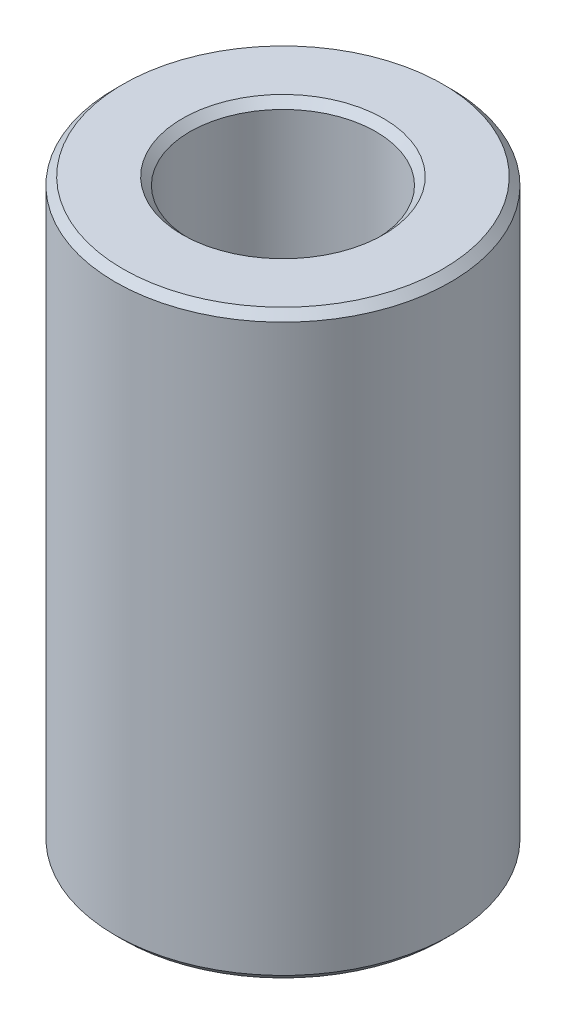
ISO-10303-21;
HEADER;
FILE_DESCRIPTION(('STEP AP214'),'2;1');
FILE_NAME('part.step','',(''),(''),'','','');
FILE_SCHEMA(('AUTOMOTIVE_DESIGN { 1 0 10303 214 1 1 1 1 }'));
ENDSEC;
DATA;
#1=APPLICATION_CONTEXT('core data for automotive mechanical design processes');
#2=APPLICATION_PROTOCOL_DEFINITION('international standard','automotive_design',2000,#1);
#3=PRODUCT_CONTEXT('',#1,'mechanical');
#4=PRODUCT('Part','Part','',(#3));
#5=PRODUCT_RELATED_PRODUCT_CATEGORY('part','',(#4));
#6=PRODUCT_DEFINITION_FORMATION('','',#4);
#7=PRODUCT_DEFINITION_CONTEXT('part definition',#1,'design');
#8=PRODUCT_DEFINITION('design','',#6,#7);
#9=PRODUCT_DEFINITION_SHAPE('','',#8);
#10=(LENGTH_UNIT() NAMED_UNIT(*) SI_UNIT(.MILLI.,.METRE.));
#11=(NAMED_UNIT(*) PLANE_ANGLE_UNIT() SI_UNIT($,.RADIAN.));
#12=(NAMED_UNIT(*) SI_UNIT($,.STERADIAN.) SOLID_ANGLE_UNIT());
#13=UNCERTAINTY_MEASURE_WITH_UNIT(LENGTH_MEASURE(1.E-05),#10,'distance_accuracy_value','');
#14=(GEOMETRIC_REPRESENTATION_CONTEXT(3) GLOBAL_UNCERTAINTY_ASSIGNED_CONTEXT((#13)) GLOBAL_UNIT_ASSIGNED_CONTEXT((#10,
#11,#12)) REPRESENTATION_CONTEXT('',''));
#15=CARTESIAN_POINT('',(0.,0.,0.));
#16=DIRECTION('',(0.,0.,1.));
#17=DIRECTION('',(1.,0.,0.));
#18=AXIS2_PLACEMENT_3D('',#15,#16,#17);
#19=CARTESIAN_POINT('',(0.,95.3080789271913,0.));
#20=DIRECTION('',(0.,-1.,0.));
#21=DIRECTION('',(0.,0.,-1.));
#22=AXIS2_PLACEMENT_3D('',#19,#20,#21);
#23=CYLINDRICAL_SURFACE('',#22,27.5);
#24=CARTESIAN_POINT('',(0.,1.24708160660957,0.));
#25=DIRECTION('',(0.,1.,0.));
#26=DIRECTION('',(0.,0.,1.));
#27=AXIS2_PLACEMENT_3D('',#24,#25,#26);
#28=CIRCLE('',#27,27.5);
#29=CARTESIAN_POINT('',(0.,1.24708160660957,27.5));
#30=VERTEX_POINT('',#29);
#31=EDGE_CURVE('E10',#30,#30,#28,.T.);
#32=ORIENTED_EDGE('',*,*,#31,.T.);
#33=EDGE_LOOP('',(#32));
#34=FACE_BOUND('',#33,.T.);
#35=CARTESIAN_POINT('',(0.,94.0609973205817,0.));
#36=DIRECTION('',(0.,1.,0.));
#37=DIRECTION('',(0.,0.,1.));
#38=AXIS2_PLACEMENT_3D('',#35,#36,#37);
#39=CIRCLE('',#38,27.5);
#40=CARTESIAN_POINT('',(0.,94.0609973205817,27.5));
#41=VERTEX_POINT('',#40);
#42=EDGE_CURVE('E50',#41,#41,#39,.F.);
#43=ORIENTED_EDGE('',*,*,#42,.T.);
#44=EDGE_LOOP('',(#43));
#45=FACE_BOUND('',#44,.T.);
#46=ADVANCED_FACE('F39',(#34,#45),#23,.T.);
#47=CARTESIAN_POINT('',(0.,95.3080789271913,0.));
#48=DIRECTION('',(0.,1.,0.));
#49=DIRECTION('',(0.,0.,1.));
#50=AXIS2_PLACEMENT_3D('',#47,#48,#49);
#51=PLANE('',#50);
#52=CARTESIAN_POINT('',(0.,95.3080789271913,0.));
#53=DIRECTION('',(0.,1.,0.));
#54=DIRECTION('',(0.,0.,1.));
#55=AXIS2_PLACEMENT_3D('',#52,#53,#54);
#56=CIRCLE('',#55,16.5118054933737);
#57=CARTESIAN_POINT('',(0.,95.3080789271913,16.5118054933737));
#58=VERTEX_POINT('',#57);
#59=EDGE_CURVE('E58',#58,#58,#56,.F.);
#60=ORIENTED_EDGE('',*,*,#59,.T.);
#61=EDGE_LOOP('',(#60));
#62=FACE_BOUND('',#61,.T.);
#63=CARTESIAN_POINT('',(0.,95.3080789271913,0.));
#64=DIRECTION('',(0.,1.,0.));
#65=DIRECTION('',(0.,0.,1.));
#66=AXIS2_PLACEMENT_3D('',#63,#64,#65);
#67=CIRCLE('',#66,26.2529183933904);
#68=CARTESIAN_POINT('',(0.,95.3080789271913,26.2529183933904));
#69=VERTEX_POINT('',#68);
#70=EDGE_CURVE('E61',#69,#69,#67,.T.);
#71=ORIENTED_EDGE('',*,*,#70,.T.);
#72=EDGE_LOOP('',(#71));
#73=FACE_BOUND('',#72,.T.);
#74=ADVANCED_FACE('F88',(#62,#73),#51,.T.);
#75=CARTESIAN_POINT('',(0.,0.,0.));
#76=DIRECTION('',(0.,1.,0.));
#77=DIRECTION('',(0.,0.,1.));
#78=AXIS2_PLACEMENT_3D('',#75,#76,#77);
#79=PLANE('',#78);
#80=CARTESIAN_POINT('',(0.,0.,0.));
#81=DIRECTION('',(0.,1.,0.));
#82=DIRECTION('',(0.,0.,1.));
#83=AXIS2_PLACEMENT_3D('',#80,#81,#82);
#84=CIRCLE('',#83,16.5118054933737);
#85=CARTESIAN_POINT('',(0.,0.,16.5118054933737));
#86=VERTEX_POINT('',#85);
#87=EDGE_CURVE('E51',#86,#86,#84,.T.);
#88=ORIENTED_EDGE('',*,*,#87,.T.);
#89=EDGE_LOOP('',(#88));
#90=FACE_BOUND('',#89,.T.);
#91=CARTESIAN_POINT('',(0.,0.,0.));
#92=DIRECTION('',(0.,1.,0.));
#93=DIRECTION('',(0.,0.,1.));
#94=AXIS2_PLACEMENT_3D('',#91,#92,#93);
#95=CIRCLE('',#94,26.2529183933904);
#96=CARTESIAN_POINT('',(0.,0.,26.2529183933904));
#97=VERTEX_POINT('',#96);
#98=EDGE_CURVE('E54',#97,#97,#95,.F.);
#99=ORIENTED_EDGE('',*,*,#98,.T.);
#100=EDGE_LOOP('',(#99));
#101=FACE_BOUND('',#100,.T.);
#102=ADVANCED_FACE('F83',(#90,#101),#79,.F.);
#103=CARTESIAN_POINT('',(0.,95.3080789271913,0.));
#104=DIRECTION('',(0.,-1.,0.));
#105=DIRECTION('',(0.,0.,-1.));
#106=AXIS2_PLACEMENT_3D('',#103,#104,#105);
#107=CYLINDRICAL_SURFACE('',#106,15.2647238867642);
#108=CARTESIAN_POINT('',(0.,94.0609973205818,0.));
#109=DIRECTION('',(0.,1.,0.));
#110=DIRECTION('',(0.,0.,1.));
#111=AXIS2_PLACEMENT_3D('',#108,#109,#110);
#112=CIRCLE('',#111,15.2647238867642);
#113=CARTESIAN_POINT('',(0.,94.0609973205818,15.2647238867642));
#114=VERTEX_POINT('',#113);
#115=EDGE_CURVE('E67',#114,#114,#112,.T.);
#116=ORIENTED_EDGE('',*,*,#115,.T.);
#117=EDGE_LOOP('',(#116));
#118=FACE_BOUND('',#117,.T.);
#119=CARTESIAN_POINT('',(0.,1.24708160660957,0.));
#120=DIRECTION('',(0.,1.,0.));
#121=DIRECTION('',(0.,0.,1.));
#122=AXIS2_PLACEMENT_3D('',#119,#120,#121);
#123=CIRCLE('',#122,15.2647238867642);
#124=CARTESIAN_POINT('',(0.,1.24708160660957,15.2647238867642));
#125=VERTEX_POINT('',#124);
#126=EDGE_CURVE('E69',#125,#125,#123,.F.);
#127=ORIENTED_EDGE('',*,*,#126,.T.);
#128=EDGE_LOOP('',(#127));
#129=FACE_BOUND('',#128,.T.);
#130=ADVANCED_FACE('F71',(#118,#129),#107,.F.);
#131=CARTESIAN_POINT('',(0.,94.0609973205818,0.));
#132=DIRECTION('',(0.,1.,0.));
#133=DIRECTION('',(0.,0.,1.));
#134=AXIS2_PLACEMENT_3D('',#131,#132,#133);
#135=CONICAL_SURFACE('',#134,15.2647238867642,0.785398163397451);
#136=ORIENTED_EDGE('',*,*,#59,.F.);
#137=EDGE_LOOP('',(#136));
#138=FACE_BOUND('',#137,.T.);
#139=ORIENTED_EDGE('',*,*,#115,.F.);
#140=EDGE_LOOP('',(#139));
#141=FACE_BOUND('',#140,.T.);
#142=ADVANCED_FACE('F77',(#138,#141),#135,.F.);
#143=CARTESIAN_POINT('',(0.,0.,0.));
#144=DIRECTION('',(0.,-1.,0.));
#145=DIRECTION('',(0.,0.,-1.));
#146=AXIS2_PLACEMENT_3D('',#143,#144,#145);
#147=CONICAL_SURFACE('',#146,16.5118054933737,0.785398163397446);
#148=ORIENTED_EDGE('',*,*,#126,.F.);
#149=EDGE_LOOP('',(#148));
#150=FACE_BOUND('',#149,.T.);
#151=ORIENTED_EDGE('',*,*,#87,.F.);
#152=EDGE_LOOP('',(#151));
#153=FACE_BOUND('',#152,.T.);
#154=ADVANCED_FACE('F73',(#150,#153),#147,.F.);
#155=CARTESIAN_POINT('',(0.,1.24708160660957,0.));
#156=DIRECTION('',(0.,1.,0.));
#157=DIRECTION('',(0.,0.,1.));
#158=AXIS2_PLACEMENT_3D('',#155,#156,#157);
#159=CONICAL_SURFACE('',#158,27.5,0.785398163397447);
#160=ORIENTED_EDGE('',*,*,#98,.F.);
#161=EDGE_LOOP('',(#160));
#162=FACE_BOUND('',#161,.T.);
#163=ORIENTED_EDGE('',*,*,#31,.F.);
#164=EDGE_LOOP('',(#163));
#165=FACE_BOUND('',#164,.T.);
#166=ADVANCED_FACE('F76',(#162,#165),#159,.T.);
#167=CARTESIAN_POINT('',(0.,95.3080789271913,0.));
#168=DIRECTION('',(0.,-1.,0.));
#169=DIRECTION('',(0.,0.,-1.));
#170=AXIS2_PLACEMENT_3D('',#167,#168,#169);
#171=CONICAL_SURFACE('',#170,26.2529183933904,0.78539816339745);
#172=ORIENTED_EDGE('',*,*,#42,.F.);
#173=EDGE_LOOP('',(#172));
#174=FACE_BOUND('',#173,.T.);
#175=ORIENTED_EDGE('',*,*,#70,.F.);
#176=EDGE_LOOP('',(#175));
#177=FACE_BOUND('',#176,.T.);
#178=ADVANCED_FACE('F45',(#174,#177),#171,.T.);
#179=CLOSED_SHELL('',(#46,#74,#102,#130,#142,#154,#166,#178));
#180=MANIFOLD_SOLID_BREP('B2',#179);
#181=ADVANCED_BREP_SHAPE_REPRESENTATION('',(#18,#180),#14);
#182=SHAPE_DEFINITION_REPRESENTATION(#9,#181);
ENDSEC;
END-ISO-10303-21;
